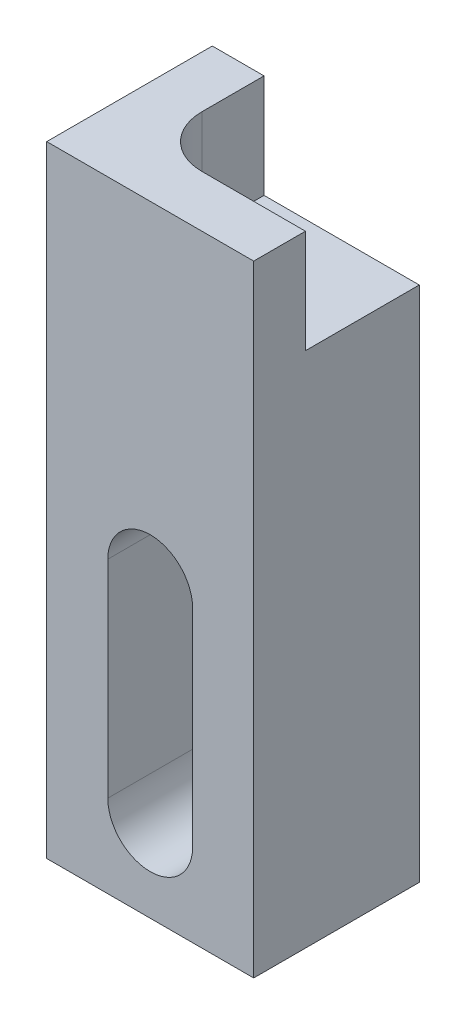
ISO-10303-21;
HEADER;
FILE_DESCRIPTION(('STEP AP214'),'2;1');
FILE_NAME('part.step','',(''),(''),'','','');
FILE_SCHEMA(('AUTOMOTIVE_DESIGN { 1 0 10303 214 1 1 1 1 }'));
ENDSEC;
DATA;
#1=APPLICATION_CONTEXT('core data for automotive mechanical design processes');
#2=APPLICATION_PROTOCOL_DEFINITION('international standard','automotive_design',2000,#1);
#3=PRODUCT_CONTEXT('',#1,'mechanical');
#4=PRODUCT('Part','Part','',(#3));
#5=PRODUCT_RELATED_PRODUCT_CATEGORY('part','',(#4));
#6=PRODUCT_DEFINITION_FORMATION('','',#4);
#7=PRODUCT_DEFINITION_CONTEXT('part definition',#1,'design');
#8=PRODUCT_DEFINITION('design','',#6,#7);
#9=PRODUCT_DEFINITION_SHAPE('','',#8);
#10=(LENGTH_UNIT() NAMED_UNIT(*) SI_UNIT(.MILLI.,.METRE.));
#11=(NAMED_UNIT(*) PLANE_ANGLE_UNIT() SI_UNIT($,.RADIAN.));
#12=(NAMED_UNIT(*) SI_UNIT($,.STERADIAN.) SOLID_ANGLE_UNIT());
#13=UNCERTAINTY_MEASURE_WITH_UNIT(LENGTH_MEASURE(1.E-05),#10,'distance_accuracy_value','');
#14=(GEOMETRIC_REPRESENTATION_CONTEXT(3) GLOBAL_UNCERTAINTY_ASSIGNED_CONTEXT((#13)) GLOBAL_UNIT_ASSIGNED_CONTEXT((#10,
#11,#12)) REPRESENTATION_CONTEXT('',''));
#15=CARTESIAN_POINT('',(0.,0.,0.));
#16=DIRECTION('',(0.,0.,1.));
#17=DIRECTION('',(1.,0.,0.));
#18=AXIS2_PLACEMENT_3D('',#15,#16,#17);
#19=CARTESIAN_POINT('',(0.,0.,8.));
#20=DIRECTION('',(0.,0.,-1.));
#21=DIRECTION('',(-1.,0.,0.));
#22=AXIS2_PLACEMENT_3D('',#19,#20,#21);
#23=PLANE('',#22);
#24=DIRECTION('',(0.,-1.,0.));
#25=VECTOR('',#24,1.);
#26=CARTESIAN_POINT('',(-10.,0.,8.));
#27=LINE('',#26,#25);
#28=CARTESIAN_POINT('',(-10.,60.,8.));
#29=VERTEX_POINT('',#28);
#30=CARTESIAN_POINT('',(-10.,0.,8.));
#31=VERTEX_POINT('',#30);
#32=EDGE_CURVE('E152',#29,#31,#27,.T.);
#33=ORIENTED_EDGE('',*,*,#32,.T.);
#34=DIRECTION('',(1.,0.,0.));
#35=VECTOR('',#34,1.);
#36=CARTESIAN_POINT('',(-10.,0.,8.));
#37=LINE('',#36,#35);
#38=CARTESIAN_POINT('',(10.,0.,8.));
#39=VERTEX_POINT('',#38);
#40=EDGE_CURVE('E214',#31,#39,#37,.T.);
#41=ORIENTED_EDGE('',*,*,#40,.T.);
#42=DIRECTION('',(0.,1.,0.));
#43=VECTOR('',#42,1.);
#44=CARTESIAN_POINT('',(10.,0.,8.));
#45=LINE('',#44,#43);
#46=CARTESIAN_POINT('',(10.,60.,8.));
#47=VERTEX_POINT('',#46);
#48=EDGE_CURVE('E171',#39,#47,#45,.T.);
#49=ORIENTED_EDGE('',*,*,#48,.T.);
#50=DIRECTION('',(-1.,0.,0.));
#51=VECTOR('',#50,1.);
#52=CARTESIAN_POINT('',(-10.,60.,8.));
#53=LINE('',#52,#51);
#54=EDGE_CURVE('E162',#47,#29,#53,.T.);
#55=ORIENTED_EDGE('',*,*,#54,.T.);
#56=EDGE_LOOP('',(#33,#41,#49,#55));
#57=FACE_BOUND('',#56,.T.);
#58=CARTESIAN_POINT('',(-1.38819675693931E-12,28.,8.));
#59=DIRECTION('',(0.,0.,1.));
#60=DIRECTION('',(1.,0.,0.));
#61=AXIS2_PLACEMENT_3D('',#58,#59,#60);
#62=CIRCLE('',#61,4.10000000000005);
#63=CARTESIAN_POINT('',(4.10000000000006,28.,8.));
#64=VERTEX_POINT('',#63);
#65=CARTESIAN_POINT('',(-4.10000000000005,28.,8.));
#66=VERTEX_POINT('',#65);
#67=EDGE_CURVE('E187',#64,#66,#62,.T.);
#68=ORIENTED_EDGE('',*,*,#67,.F.);
#69=DIRECTION('',(0.,1.,0.));
#70=VECTOR('',#69,1.);
#71=CARTESIAN_POINT('',(4.10000000000006,28.,8.));
#72=LINE('',#71,#70);
#73=CARTESIAN_POINT('',(4.10000000000005,8.,8.));
#74=VERTEX_POINT('',#73);
#75=EDGE_CURVE('E194',#74,#64,#72,.T.);
#76=ORIENTED_EDGE('',*,*,#75,.F.);
#77=CARTESIAN_POINT('',(0.,8.,8.));
#78=DIRECTION('',(0.,0.,1.));
#79=DIRECTION('',(1.,0.,0.));
#80=AXIS2_PLACEMENT_3D('',#77,#78,#79);
#81=CIRCLE('',#80,4.10000000000005);
#82=CARTESIAN_POINT('',(-4.10000000000005,8.,8.));
#83=VERTEX_POINT('',#82);
#84=EDGE_CURVE('E192',#83,#74,#81,.T.);
#85=ORIENTED_EDGE('',*,*,#84,.F.);
#86=DIRECTION('',(0.,-1.,0.));
#87=VECTOR('',#86,1.);
#88=CARTESIAN_POINT('',(-4.10000000000005,28.,8.));
#89=LINE('',#88,#87);
#90=EDGE_CURVE('E189',#66,#83,#89,.T.);
#91=ORIENTED_EDGE('',*,*,#90,.F.);
#92=EDGE_LOOP('',(#68,#76,#85,#91));
#93=FACE_BOUND('',#92,.T.);
#94=ADVANCED_FACE('F33',(#57,#93),#23,.F.);
#95=CARTESIAN_POINT('',(0.,0.,-8.));
#96=DIRECTION('',(0.,0.,-1.));
#97=DIRECTION('',(-1.,0.,0.));
#98=AXIS2_PLACEMENT_3D('',#95,#96,#97);
#99=PLANE('',#98);
#100=DIRECTION('',(0.,1.,0.));
#101=VECTOR('',#100,1.);
#102=CARTESIAN_POINT('',(-5.,50.,-8.));
#103=LINE('',#102,#101);
#104=CARTESIAN_POINT('',(-5.,50.,-8.));
#105=VERTEX_POINT('',#104);
#106=CARTESIAN_POINT('',(-5.,60.,-8.));
#107=VERTEX_POINT('',#106);
#108=EDGE_CURVE('E48',#105,#107,#103,.T.);
#109=ORIENTED_EDGE('',*,*,#108,.F.);
#110=DIRECTION('',(-1.,0.,0.));
#111=VECTOR('',#110,1.);
#112=CARTESIAN_POINT('',(-5.,50.,-8.));
#113=LINE('',#112,#111);
#114=CARTESIAN_POINT('',(10.,50.,-8.));
#115=VERTEX_POINT('',#114);
#116=EDGE_CURVE('E128',#115,#105,#113,.T.);
#117=ORIENTED_EDGE('',*,*,#116,.F.);
#118=DIRECTION('',(0.,1.,0.));
#119=VECTOR('',#118,1.);
#120=CARTESIAN_POINT('',(10.,0.,-8.));
#121=LINE('',#120,#119);
#122=CARTESIAN_POINT('',(10.,0.,-8.));
#123=VERTEX_POINT('',#122);
#124=EDGE_CURVE('E141',#123,#115,#121,.T.);
#125=ORIENTED_EDGE('',*,*,#124,.F.);
#126=DIRECTION('',(1.,0.,0.));
#127=VECTOR('',#126,1.);
#128=CARTESIAN_POINT('',(-10.,0.,-8.));
#129=LINE('',#128,#127);
#130=CARTESIAN_POINT('',(-10.,0.,-8.));
#131=VERTEX_POINT('',#130);
#132=EDGE_CURVE('E150',#131,#123,#129,.T.);
#133=ORIENTED_EDGE('',*,*,#132,.F.);
#134=DIRECTION('',(0.,-1.,0.));
#135=VECTOR('',#134,1.);
#136=CARTESIAN_POINT('',(-10.,0.,-8.));
#137=LINE('',#136,#135);
#138=CARTESIAN_POINT('',(-10.,60.,-8.));
#139=VERTEX_POINT('',#138);
#140=EDGE_CURVE('E154',#139,#131,#137,.T.);
#141=ORIENTED_EDGE('',*,*,#140,.F.);
#142=DIRECTION('',(-1.,0.,0.));
#143=VECTOR('',#142,1.);
#144=CARTESIAN_POINT('',(-10.,60.,-8.));
#145=LINE('',#144,#143);
#146=EDGE_CURVE('E149',#107,#139,#145,.T.);
#147=ORIENTED_EDGE('',*,*,#146,.F.);
#148=EDGE_LOOP('',(#109,#117,#125,#133,#141,#147));
#149=FACE_BOUND('',#148,.T.);
#150=DIRECTION('',(0.,1.,0.));
#151=VECTOR('',#150,1.);
#152=CARTESIAN_POINT('',(4.10000000000006,28.,-8.));
#153=LINE('',#152,#151);
#154=CARTESIAN_POINT('',(4.10000000000005,8.,-8.));
#155=VERTEX_POINT('',#154);
#156=CARTESIAN_POINT('',(4.10000000000006,28.,-8.));
#157=VERTEX_POINT('',#156);
#158=EDGE_CURVE('E190',#155,#157,#153,.T.);
#159=ORIENTED_EDGE('',*,*,#158,.T.);
#160=CARTESIAN_POINT('',(-1.38819675693931E-12,28.,-8.));
#161=DIRECTION('',(0.,0.,1.));
#162=DIRECTION('',(1.,0.,0.));
#163=AXIS2_PLACEMENT_3D('',#160,#161,#162);
#164=CIRCLE('',#163,4.10000000000005);
#165=CARTESIAN_POINT('',(-4.10000000000005,28.,-8.));
#166=VERTEX_POINT('',#165);
#167=EDGE_CURVE('E174',#157,#166,#164,.T.);
#168=ORIENTED_EDGE('',*,*,#167,.T.);
#169=DIRECTION('',(0.,-1.,0.));
#170=VECTOR('',#169,1.);
#171=CARTESIAN_POINT('',(-4.10000000000005,28.,-8.));
#172=LINE('',#171,#170);
#173=CARTESIAN_POINT('',(-4.10000000000005,8.,-8.));
#174=VERTEX_POINT('',#173);
#175=EDGE_CURVE('E178',#166,#174,#172,.T.);
#176=ORIENTED_EDGE('',*,*,#175,.T.);
#177=CARTESIAN_POINT('',(0.,8.,-8.));
#178=DIRECTION('',(0.,0.,1.));
#179=DIRECTION('',(1.,0.,0.));
#180=AXIS2_PLACEMENT_3D('',#177,#178,#179);
#181=CIRCLE('',#180,4.10000000000005);
#182=EDGE_CURVE('E199',#174,#155,#181,.T.);
#183=ORIENTED_EDGE('',*,*,#182,.T.);
#184=EDGE_LOOP('',(#159,#168,#176,#183));
#185=FACE_BOUND('',#184,.T.);
#186=ADVANCED_FACE('F139',(#149,#185),#99,.T.);
#187=CARTESIAN_POINT('',(-10.,0.,8.));
#188=DIRECTION('',(1.,0.,0.));
#189=DIRECTION('',(0.,0.,-1.));
#190=AXIS2_PLACEMENT_3D('',#187,#188,#189);
#191=PLANE('',#190);
#192=ORIENTED_EDGE('',*,*,#140,.T.);
#193=DIRECTION('',(0.,0.,-1.));
#194=VECTOR('',#193,1.);
#195=CARTESIAN_POINT('',(-10.,0.,8.));
#196=LINE('',#195,#194);
#197=EDGE_CURVE('E11',#31,#131,#196,.T.);
#198=ORIENTED_EDGE('',*,*,#197,.F.);
#199=ORIENTED_EDGE('',*,*,#32,.F.);
#200=DIRECTION('',(0.,0.,-1.));
#201=VECTOR('',#200,1.);
#202=CARTESIAN_POINT('',(-10.,60.,8.));
#203=LINE('',#202,#201);
#204=EDGE_CURVE('E158',#29,#139,#203,.T.);
#205=ORIENTED_EDGE('',*,*,#204,.T.);
#206=EDGE_LOOP('',(#192,#198,#199,#205));
#207=FACE_BOUND('',#206,.T.);
#208=ADVANCED_FACE('F35',(#207),#191,.F.);
#209=CARTESIAN_POINT('',(-10.,0.,8.));
#210=DIRECTION('',(0.,1.,0.));
#211=DIRECTION('',(0.,0.,1.));
#212=AXIS2_PLACEMENT_3D('',#209,#210,#211);
#213=PLANE('',#212);
#214=ORIENTED_EDGE('',*,*,#132,.T.);
#215=DIRECTION('',(0.,0.,-1.));
#216=VECTOR('',#215,1.);
#217=CARTESIAN_POINT('',(10.,0.,8.));
#218=LINE('',#217,#216);
#219=EDGE_CURVE('E41',#39,#123,#218,.T.);
#220=ORIENTED_EDGE('',*,*,#219,.F.);
#221=ORIENTED_EDGE('',*,*,#40,.F.);
#222=ORIENTED_EDGE('',*,*,#197,.T.);
#223=EDGE_LOOP('',(#214,#220,#221,#222));
#224=FACE_BOUND('',#223,.T.);
#225=ADVANCED_FACE('F223',(#224),#213,.F.);
#226=CARTESIAN_POINT('',(10.,0.,8.));
#227=DIRECTION('',(-1.,0.,0.));
#228=DIRECTION('',(0.,0.,1.));
#229=AXIS2_PLACEMENT_3D('',#226,#227,#228);
#230=PLANE('',#229);
#231=DIRECTION('',(0.,0.,-1.));
#232=VECTOR('',#231,1.);
#233=CARTESIAN_POINT('',(10.,50.,-8.));
#234=LINE('',#233,#232);
#235=CARTESIAN_POINT('',(10.,50.,3.));
#236=VERTEX_POINT('',#235);
#237=EDGE_CURVE('E124',#236,#115,#234,.T.);
#238=ORIENTED_EDGE('',*,*,#237,.F.);
#239=DIRECTION('',(0.,1.,0.));
#240=VECTOR('',#239,1.);
#241=CARTESIAN_POINT('',(10.,50.,3.));
#242=LINE('',#241,#240);
#243=CARTESIAN_POINT('',(10.,60.,3.));
#244=VERTEX_POINT('',#243);
#245=EDGE_CURVE('E172',#236,#244,#242,.T.);
#246=ORIENTED_EDGE('',*,*,#245,.T.);
#247=DIRECTION('',(0.,0.,-1.));
#248=VECTOR('',#247,1.);
#249=CARTESIAN_POINT('',(10.,60.,8.));
#250=LINE('',#249,#248);
#251=EDGE_CURVE('E161',#47,#244,#250,.T.);
#252=ORIENTED_EDGE('',*,*,#251,.F.);
#253=ORIENTED_EDGE('',*,*,#48,.F.);
#254=ORIENTED_EDGE('',*,*,#219,.T.);
#255=ORIENTED_EDGE('',*,*,#124,.T.);
#256=EDGE_LOOP('',(#238,#246,#252,#253,#254,#255));
#257=FACE_BOUND('',#256,.T.);
#258=ADVANCED_FACE('F146',(#257),#230,.F.);
#259=CARTESIAN_POINT('',(-10.,60.,8.));
#260=DIRECTION('',(0.,-1.,0.));
#261=DIRECTION('',(0.,0.,-1.));
#262=AXIS2_PLACEMENT_3D('',#259,#260,#261);
#263=PLANE('',#262);
#264=ORIENTED_EDGE('',*,*,#251,.T.);
#265=DIRECTION('',(1.,0.,0.));
#266=VECTOR('',#265,1.);
#267=CARTESIAN_POINT('',(10.,60.,3.));
#268=LINE('',#267,#266);
#269=CARTESIAN_POINT('',(0.,60.,3.));
#270=VERTEX_POINT('',#269);
#271=EDGE_CURVE('E135',#270,#244,#268,.T.);
#272=ORIENTED_EDGE('',*,*,#271,.F.);
#273=CARTESIAN_POINT('',(0.,60.,-2.));
#274=DIRECTION('',(0.,1.,0.));
#275=DIRECTION('',(0.,0.,-1.));
#276=AXIS2_PLACEMENT_3D('',#273,#274,#275);
#277=CIRCLE('',#276,5.);
#278=CARTESIAN_POINT('',(-5.,60.,-2.00000000000004));
#279=VERTEX_POINT('',#278);
#280=EDGE_CURVE('E228',#279,#270,#277,.T.);
#281=ORIENTED_EDGE('',*,*,#280,.F.);
#282=DIRECTION('',(0.,0.,1.));
#283=VECTOR('',#282,1.);
#284=CARTESIAN_POINT('',(-5.,60.,-2.00000000000004));
#285=LINE('',#284,#283);
#286=EDGE_CURVE('E226',#107,#279,#285,.T.);
#287=ORIENTED_EDGE('',*,*,#286,.F.);
#288=ORIENTED_EDGE('',*,*,#146,.T.);
#289=ORIENTED_EDGE('',*,*,#204,.F.);
#290=ORIENTED_EDGE('',*,*,#54,.F.);
#291=EDGE_LOOP('',(#264,#272,#281,#287,#288,#289,#290));
#292=FACE_BOUND('',#291,.T.);
#293=ADVANCED_FACE('F168',(#292),#263,.F.);
#294=CARTESIAN_POINT('',(-1.38819675693931E-12,28.,8.));
#295=DIRECTION('',(0.,0.,-1.));
#296=DIRECTION('',(-1.,0.,0.));
#297=AXIS2_PLACEMENT_3D('',#294,#295,#296);
#298=CYLINDRICAL_SURFACE('',#297,4.10000000000005);
#299=ORIENTED_EDGE('',*,*,#167,.F.);
#300=DIRECTION('',(0.,0.,-1.));
#301=VECTOR('',#300,1.);
#302=CARTESIAN_POINT('',(4.10000000000006,28.,8.));
#303=LINE('',#302,#301);
#304=EDGE_CURVE('E195',#64,#157,#303,.T.);
#305=ORIENTED_EDGE('',*,*,#304,.F.);
#306=ORIENTED_EDGE('',*,*,#67,.T.);
#307=DIRECTION('',(0.,0.,-1.));
#308=VECTOR('',#307,1.);
#309=CARTESIAN_POINT('',(-4.10000000000005,28.,8.));
#310=LINE('',#309,#308);
#311=EDGE_CURVE('E209',#66,#166,#310,.T.);
#312=ORIENTED_EDGE('',*,*,#311,.T.);
#313=EDGE_LOOP('',(#299,#305,#306,#312));
#314=FACE_BOUND('',#313,.T.);
#315=ADVANCED_FACE('F257',(#314),#298,.F.);
#316=CARTESIAN_POINT('',(-4.10000000000005,28.,8.));
#317=DIRECTION('',(1.,0.,0.));
#318=DIRECTION('',(0.,1.,0.));
#319=AXIS2_PLACEMENT_3D('',#316,#317,#318);
#320=PLANE('',#319);
#321=ORIENTED_EDGE('',*,*,#175,.F.);
#322=ORIENTED_EDGE('',*,*,#311,.F.);
#323=ORIENTED_EDGE('',*,*,#90,.T.);
#324=DIRECTION('',(0.,0.,-1.));
#325=VECTOR('',#324,1.);
#326=CARTESIAN_POINT('',(-4.10000000000005,8.,8.));
#327=LINE('',#326,#325);
#328=EDGE_CURVE('E207',#83,#174,#327,.T.);
#329=ORIENTED_EDGE('',*,*,#328,.T.);
#330=EDGE_LOOP('',(#321,#322,#323,#329));
#331=FACE_BOUND('',#330,.T.);
#332=ADVANCED_FACE('F324',(#331),#320,.T.);
#333=CARTESIAN_POINT('',(0.,8.,8.));
#334=DIRECTION('',(0.,0.,-1.));
#335=DIRECTION('',(-1.,0.,0.));
#336=AXIS2_PLACEMENT_3D('',#333,#334,#335);
#337=CYLINDRICAL_SURFACE('',#336,4.10000000000005);
#338=ORIENTED_EDGE('',*,*,#182,.F.);
#339=ORIENTED_EDGE('',*,*,#328,.F.);
#340=ORIENTED_EDGE('',*,*,#84,.T.);
#341=DIRECTION('',(0.,0.,-1.));
#342=VECTOR('',#341,1.);
#343=CARTESIAN_POINT('',(4.10000000000005,8.,8.));
#344=LINE('',#343,#342);
#345=EDGE_CURVE('E56',#74,#155,#344,.T.);
#346=ORIENTED_EDGE('',*,*,#345,.T.);
#347=EDGE_LOOP('',(#338,#339,#340,#346));
#348=FACE_BOUND('',#347,.T.);
#349=ADVANCED_FACE('F247',(#348),#337,.F.);
#350=CARTESIAN_POINT('',(4.10000000000006,28.,8.));
#351=DIRECTION('',(-1.,0.,0.));
#352=DIRECTION('',(0.,-1.,0.));
#353=AXIS2_PLACEMENT_3D('',#350,#351,#352);
#354=PLANE('',#353);
#355=ORIENTED_EDGE('',*,*,#158,.F.);
#356=ORIENTED_EDGE('',*,*,#345,.F.);
#357=ORIENTED_EDGE('',*,*,#75,.T.);
#358=ORIENTED_EDGE('',*,*,#304,.T.);
#359=EDGE_LOOP('',(#355,#356,#357,#358));
#360=FACE_BOUND('',#359,.T.);
#361=ADVANCED_FACE('F240',(#360),#354,.T.);
#362=CARTESIAN_POINT('',(10.,50.,3.));
#363=DIRECTION('',(0.,0.,1.));
#364=DIRECTION('',(1.,0.,0.));
#365=AXIS2_PLACEMENT_3D('',#362,#363,#364);
#366=PLANE('',#365);
#367=ORIENTED_EDGE('',*,*,#271,.T.);
#368=ORIENTED_EDGE('',*,*,#245,.F.);
#369=DIRECTION('',(1.,0.,0.));
#370=VECTOR('',#369,1.);
#371=CARTESIAN_POINT('',(10.,50.,3.));
#372=LINE('',#371,#370);
#373=CARTESIAN_POINT('',(0.,50.,3.));
#374=VERTEX_POINT('',#373);
#375=EDGE_CURVE('E131',#374,#236,#372,.T.);
#376=ORIENTED_EDGE('',*,*,#375,.F.);
#377=DIRECTION('',(0.,1.,0.));
#378=VECTOR('',#377,1.);
#379=CARTESIAN_POINT('',(0.,50.,3.));
#380=LINE('',#379,#378);
#381=EDGE_CURVE('E175',#374,#270,#380,.T.);
#382=ORIENTED_EDGE('',*,*,#381,.T.);
#383=EDGE_LOOP('',(#367,#368,#376,#382));
#384=FACE_BOUND('',#383,.T.);
#385=ADVANCED_FACE('F238',(#384),#366,.F.);
#386=CARTESIAN_POINT('',(0.,50.,-2.));
#387=DIRECTION('',(0.,1.,0.));
#388=DIRECTION('',(0.,0.,1.));
#389=AXIS2_PLACEMENT_3D('',#386,#387,#388);
#390=CYLINDRICAL_SURFACE('',#389,5.);
#391=ORIENTED_EDGE('',*,*,#280,.T.);
#392=ORIENTED_EDGE('',*,*,#381,.F.);
#393=CARTESIAN_POINT('',(0.,50.,-2.));
#394=DIRECTION('',(0.,1.,0.));
#395=DIRECTION('',(0.,0.,-1.));
#396=AXIS2_PLACEMENT_3D('',#393,#394,#395);
#397=CIRCLE('',#396,5.);
#398=CARTESIAN_POINT('',(-5.,50.,-2.00000000000004));
#399=VERTEX_POINT('',#398);
#400=EDGE_CURVE('E232',#399,#374,#397,.T.);
#401=ORIENTED_EDGE('',*,*,#400,.F.);
#402=DIRECTION('',(0.,1.,0.));
#403=VECTOR('',#402,1.);
#404=CARTESIAN_POINT('',(-5.,50.,-2.00000000000004));
#405=LINE('',#404,#403);
#406=EDGE_CURVE('E180',#399,#279,#405,.T.);
#407=ORIENTED_EDGE('',*,*,#406,.T.);
#408=EDGE_LOOP('',(#391,#392,#401,#407));
#409=FACE_BOUND('',#408,.T.);
#410=ADVANCED_FACE('F237',(#409),#390,.F.);
#411=CARTESIAN_POINT('',(-5.,50.,-2.00000000000004));
#412=DIRECTION('',(-1.,0.,0.));
#413=DIRECTION('',(0.,0.,1.));
#414=AXIS2_PLACEMENT_3D('',#411,#412,#413);
#415=PLANE('',#414);
#416=ORIENTED_EDGE('',*,*,#286,.T.);
#417=ORIENTED_EDGE('',*,*,#406,.F.);
#418=DIRECTION('',(0.,0.,1.));
#419=VECTOR('',#418,1.);
#420=CARTESIAN_POINT('',(-5.,50.,-2.00000000000004));
#421=LINE('',#420,#419);
#422=EDGE_CURVE('E143',#105,#399,#421,.T.);
#423=ORIENTED_EDGE('',*,*,#422,.F.);
#424=ORIENTED_EDGE('',*,*,#108,.T.);
#425=EDGE_LOOP('',(#416,#417,#423,#424));
#426=FACE_BOUND('',#425,.T.);
#427=ADVANCED_FACE('F235',(#426),#415,.F.);
#428=CARTESIAN_POINT('',(0.,50.,-2.));
#429=DIRECTION('',(0.,-1.,0.));
#430=DIRECTION('',(0.,0.,-1.));
#431=AXIS2_PLACEMENT_3D('',#428,#429,#430);
#432=PLANE('',#431);
#433=ORIENTED_EDGE('',*,*,#237,.T.);
#434=ORIENTED_EDGE('',*,*,#116,.T.);
#435=ORIENTED_EDGE('',*,*,#422,.T.);
#436=ORIENTED_EDGE('',*,*,#400,.T.);
#437=ORIENTED_EDGE('',*,*,#375,.T.);
#438=EDGE_LOOP('',(#433,#434,#435,#436,#437));
#439=FACE_BOUND('',#438,.T.);
#440=ADVANCED_FACE('F126',(#439),#432,.F.);
#441=CLOSED_SHELL('',(#94,#186,#208,#225,#258,#293,#315,#332,#349,#361,#385,#410,#427,#440));
#442=MANIFOLD_SOLID_BREP('B2',#441);
#443=ADVANCED_BREP_SHAPE_REPRESENTATION('',(#18,#442),#14);
#444=SHAPE_DEFINITION_REPRESENTATION(#9,#443);
ENDSEC;
END-ISO-10303-21;
